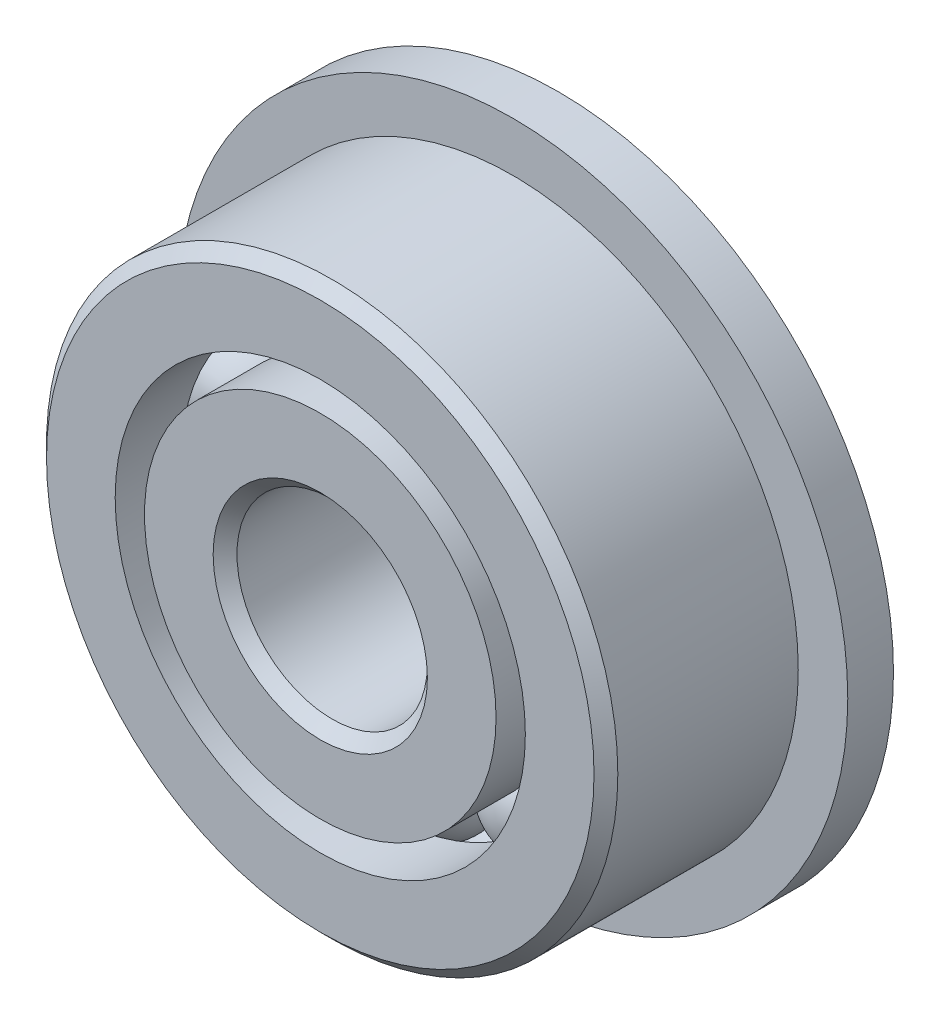
ISO-10303-21;
HEADER;
FILE_DESCRIPTION(('STEP AP214'),'2;1');
FILE_NAME('part.step','',(''),(''),'','','');
FILE_SCHEMA(('AUTOMOTIVE_DESIGN { 1 0 10303 214 1 1 1 1 }'));
ENDSEC;
DATA;
#1=APPLICATION_CONTEXT('core data for automotive mechanical design processes');
#2=APPLICATION_PROTOCOL_DEFINITION('international standard','automotive_design',2000,#1);
#3=PRODUCT_CONTEXT('',#1,'mechanical');
#4=PRODUCT('Part','Part','',(#3));
#5=PRODUCT_RELATED_PRODUCT_CATEGORY('part','',(#4));
#6=PRODUCT_DEFINITION_FORMATION('','',#4);
#7=PRODUCT_DEFINITION_CONTEXT('part definition',#1,'design');
#8=PRODUCT_DEFINITION('design','',#6,#7);
#9=PRODUCT_DEFINITION_SHAPE('','',#8);
#10=(LENGTH_UNIT() NAMED_UNIT(*) SI_UNIT(.MILLI.,.METRE.));
#11=(NAMED_UNIT(*) PLANE_ANGLE_UNIT() SI_UNIT($,.RADIAN.));
#12=(NAMED_UNIT(*) SI_UNIT($,.STERADIAN.) SOLID_ANGLE_UNIT());
#13=UNCERTAINTY_MEASURE_WITH_UNIT(LENGTH_MEASURE(1.E-05),#10,'distance_accuracy_value','');
#14=(GEOMETRIC_REPRESENTATION_CONTEXT(3) GLOBAL_UNCERTAINTY_ASSIGNED_CONTEXT((#13)) GLOBAL_UNIT_ASSIGNED_CONTEXT((#10,
#11,#12)) REPRESENTATION_CONTEXT('',''));
#15=CARTESIAN_POINT('',(0.,0.,0.));
#16=DIRECTION('',(0.,0.,1.));
#17=DIRECTION('',(1.,0.,0.));
#18=AXIS2_PLACEMENT_3D('',#15,#16,#17);
#19=CARTESIAN_POINT('',(-1.86621817602857,2.56862895714048,0.));
#20=DIRECTION('',(0.,0.,1.));
#21=DIRECTION('',(-0.587785252292462,0.809016994374955,0.));
#22=AXIS2_PLACEMENT_3D('',#19,#20,#21);
#23=SPHERICAL_SURFACE('',#22,0.915136422466876);
#24=CARTESIAN_POINT('',(-1.86621817602857,2.56862895714048,0.915136422466876));
#25=VERTEX_POINT('',#24);
#26=VERTEX_LOOP('',#25);
#27=FACE_BOUND('',#26,.T.);
#28=ADVANCED_FACE('F40',(#27),#23,.T.);
#29=CLOSED_SHELL('',(#28));
#30=MANIFOLD_SOLID_BREP('B2',#29);
#31=CARTESIAN_POINT('',(-3.0196044392371,0.981128957140492,0.));
#32=DIRECTION('',(0.,0.,1.));
#33=DIRECTION('',(-0.95105651629515,0.309016994374958,0.));
#34=AXIS2_PLACEMENT_3D('',#31,#32,#33);
#35=SPHERICAL_SURFACE('',#34,0.915136422466876);
#36=CARTESIAN_POINT('',(-3.0196044392371,0.981128957140492,0.915136422466876));
#37=VERTEX_POINT('',#36);
#38=VERTEX_LOOP('',#37);
#39=FACE_BOUND('',#38,.T.);
#40=ADVANCED_FACE('F61',(#39),#35,.T.);
#41=CLOSED_SHELL('',(#40));
#42=MANIFOLD_SOLID_BREP('B6',#41);
#43=CARTESIAN_POINT('',(-3.01960443923712,-0.981128957140429,0.));
#44=DIRECTION('',(0.,0.,1.));
#45=DIRECTION('',(-0.951056516295157,-0.309016994374938,0.));
#46=AXIS2_PLACEMENT_3D('',#43,#44,#45);
#47=SPHERICAL_SURFACE('',#46,0.915136422466876);
#48=CARTESIAN_POINT('',(-3.01960443923712,-0.981128957140429,0.915136422466876));
#49=VERTEX_POINT('',#48);
#50=VERTEX_LOOP('',#49);
#51=FACE_BOUND('',#50,.T.);
#52=ADVANCED_FACE('F82',(#51),#47,.T.);
#53=CLOSED_SHELL('',(#52));
#54=MANIFOLD_SOLID_BREP('B36',#53);
#55=CARTESIAN_POINT('',(-1.86621817602862,-2.56862895714044,0.));
#56=DIRECTION('',(0.,0.,1.));
#57=DIRECTION('',(-0.58778525229248,-0.809016994374942,0.));
#58=AXIS2_PLACEMENT_3D('',#55,#56,#57);
#59=SPHERICAL_SURFACE('',#58,0.915136422466876);
#60=CARTESIAN_POINT('',(-1.86621817602862,-2.56862895714044,0.915136422466876));
#61=VERTEX_POINT('',#60);
#62=VERTEX_LOOP('',#61);
#63=FACE_BOUND('',#62,.T.);
#64=ADVANCED_FACE('F103',(#63),#59,.T.);
#65=CLOSED_SHELL('',(#64));
#66=MANIFOLD_SOLID_BREP('B57',#65);
#67=CARTESIAN_POINT('',(0.,-3.175,0.));
#68=DIRECTION('',(0.,0.,1.));
#69=DIRECTION('',(0.,-1.,0.));
#70=AXIS2_PLACEMENT_3D('',#67,#68,#69);
#71=SPHERICAL_SURFACE('',#70,0.915136422466876);
#72=CARTESIAN_POINT('',(0.,-3.175,0.915136422466876));
#73=VERTEX_POINT('',#72);
#74=VERTEX_LOOP('',#73);
#75=FACE_BOUND('',#74,.T.);
#76=ADVANCED_FACE('F124',(#75),#71,.T.);
#77=CLOSED_SHELL('',(#76));
#78=MANIFOLD_SOLID_BREP('B78',#77);
#79=CARTESIAN_POINT('',(1.86621817602859,-2.56862895714047,0.));
#80=DIRECTION('',(0.,0.,1.));
#81=DIRECTION('',(0.587785252292469,-0.809016994374951,0.));
#82=AXIS2_PLACEMENT_3D('',#79,#80,#81);
#83=SPHERICAL_SURFACE('',#82,0.915136422466876);
#84=CARTESIAN_POINT('',(1.86621817602859,-2.56862895714047,0.915136422466876));
#85=VERTEX_POINT('',#84);
#86=VERTEX_LOOP('',#85);
#87=FACE_BOUND('',#86,.T.);
#88=ADVANCED_FACE('F145',(#87),#83,.T.);
#89=CLOSED_SHELL('',(#88));
#90=MANIFOLD_SOLID_BREP('B99',#89);
#91=CARTESIAN_POINT('',(3.01960443923711,-0.981128957140471,0.));
#92=DIRECTION('',(0.,0.,1.));
#93=DIRECTION('',(0.951056516295152,-0.309016994374952,0.));
#94=AXIS2_PLACEMENT_3D('',#91,#92,#93);
#95=SPHERICAL_SURFACE('',#94,0.915136422466876);
#96=CARTESIAN_POINT('',(3.01960443923711,-0.981128957140471,0.915136422466876));
#97=VERTEX_POINT('',#96);
#98=VERTEX_LOOP('',#97);
#99=FACE_BOUND('',#98,.T.);
#100=ADVANCED_FACE('F166',(#99),#95,.T.);
#101=CLOSED_SHELL('',(#100));
#102=MANIFOLD_SOLID_BREP('B120',#101);
#103=CARTESIAN_POINT('',(3.01960443923712,0.98112895714045,0.));
#104=DIRECTION('',(0.,0.,1.));
#105=DIRECTION('',(0.951056516295155,0.309016994374945,0.));
#106=AXIS2_PLACEMENT_3D('',#103,#104,#105);
#107=SPHERICAL_SURFACE('',#106,0.915136422466876);
#108=CARTESIAN_POINT('',(3.01960443923712,0.98112895714045,0.915136422466876));
#109=VERTEX_POINT('',#108);
#110=VERTEX_LOOP('',#109);
#111=FACE_BOUND('',#110,.T.);
#112=ADVANCED_FACE('F187',(#111),#107,.T.);
#113=CLOSED_SHELL('',(#112));
#114=MANIFOLD_SOLID_BREP('B141',#113);
#115=CARTESIAN_POINT('',(1.86621817602861,2.56862895714046,0.));
#116=DIRECTION('',(0.,0.,1.));
#117=DIRECTION('',(0.587785252292474,0.809016994374947,0.));
#118=AXIS2_PLACEMENT_3D('',#115,#116,#117);
#119=SPHERICAL_SURFACE('',#118,0.915136422466876);
#120=CARTESIAN_POINT('',(1.86621817602861,2.56862895714046,0.915136422466876));
#121=VERTEX_POINT('',#120);
#122=VERTEX_LOOP('',#121);
#123=FACE_BOUND('',#122,.T.);
#124=ADVANCED_FACE('F208',(#123),#119,.T.);
#125=CLOSED_SHELL('',(#124));
#126=MANIFOLD_SOLID_BREP('B162',#125);
#127=CARTESIAN_POINT('',(0.,3.175,0.));
#128=DIRECTION('',(0.,0.,1.));
#129=DIRECTION('',(0.,1.,0.));
#130=AXIS2_PLACEMENT_3D('',#127,#128,#129);
#131=SPHERICAL_SURFACE('',#130,0.915136422466876);
#132=CARTESIAN_POINT('',(0.,3.175,0.915136422466876));
#133=VERTEX_POINT('',#132);
#134=VERTEX_LOOP('',#133);
#135=FACE_BOUND('',#134,.T.);
#136=ADVANCED_FACE('F231',(#135),#131,.T.);
#137=CLOSED_SHELL('',(#136));
#138=MANIFOLD_SOLID_BREP('B183',#137);
#139=CARTESIAN_POINT('',(0.,2.93076923076923,1.984375));
#140=DIRECTION('',(0.,0.,-1.));
#141=DIRECTION('',(-1.,0.,0.));
#142=AXIS2_PLACEMENT_3D('',#139,#140,#141);
#143=PLANE('',#142);
#144=CARTESIAN_POINT('',(0.,0.,1.984375));
#145=DIRECTION('',(0.,0.,1.));
#146=DIRECTION('',(1.,0.,0.));
#147=AXIS2_PLACEMENT_3D('',#144,#145,#146);
#148=CIRCLE('',#147,1.7859375);
#149=CARTESIAN_POINT('',(1.7859375,0.,1.984375));
#150=VERTEX_POINT('',#149);
#151=EDGE_CURVE('E279',#150,#150,#148,.T.);
#152=ORIENTED_EDGE('',*,*,#151,.F.);
#153=EDGE_LOOP('',(#152));
#154=FACE_BOUND('',#153,.T.);
#155=CARTESIAN_POINT('',(0.,0.,1.984375));
#156=DIRECTION('',(0.,0.,1.));
#157=DIRECTION('',(1.,0.,0.));
#158=AXIS2_PLACEMENT_3D('',#155,#156,#157);
#159=CIRCLE('',#158,2.93076923076923);
#160=CARTESIAN_POINT('',(2.93076923076923,0.,1.984375));
#161=VERTEX_POINT('',#160);
#162=EDGE_CURVE('E230',#161,#161,#159,.T.);
#163=ORIENTED_EDGE('',*,*,#162,.T.);
#164=EDGE_LOOP('',(#163));
#165=FACE_BOUND('',#164,.T.);
#166=ADVANCED_FACE('F251',(#154,#165),#143,.F.);
#167=CARTESIAN_POINT('',(0.,0.,1.984375));
#168=DIRECTION('',(0.,0.,1.));
#169=DIRECTION('',(1.,0.,0.));
#170=AXIS2_PLACEMENT_3D('',#167,#168,#169);
#171=CYLINDRICAL_SURFACE('',#170,2.93076923076923);
#172=ORIENTED_EDGE('',*,*,#162,.F.);
#173=EDGE_LOOP('',(#172));
#174=FACE_BOUND('',#173,.T.);
#175=CARTESIAN_POINT('',(0.,0.,0.881944444444444));
#176=DIRECTION('',(0.,0.,1.));
#177=DIRECTION('',(1.,0.,0.));
#178=AXIS2_PLACEMENT_3D('',#175,#176,#177);
#179=CIRCLE('',#178,2.93076923076923);
#180=CARTESIAN_POINT('',(2.93076923076923,0.,0.881944444444444));
#181=VERTEX_POINT('',#180);
#182=EDGE_CURVE('E257',#181,#181,#179,.T.);
#183=ORIENTED_EDGE('',*,*,#182,.T.);
#184=EDGE_LOOP('',(#183));
#185=FACE_BOUND('',#184,.T.);
#186=ADVANCED_FACE('F286',(#174,#185),#171,.T.);
#187=CARTESIAN_POINT('',(0.,0.,0.));
#188=DIRECTION('',(0.,0.,1.));
#189=DIRECTION('',(1.,0.,0.));
#190=AXIS2_PLACEMENT_3D('',#187,#188,#189);
#191=TOROIDAL_SURFACE('',#190,3.175,0.915136422466875);
#192=ORIENTED_EDGE('',*,*,#182,.F.);
#193=EDGE_LOOP('',(#192));
#194=FACE_BOUND('',#193,.T.);
#195=CARTESIAN_POINT('',(0.,0.,-0.881944444444445));
#196=DIRECTION('',(0.,0.,1.));
#197=DIRECTION('',(1.,0.,0.));
#198=AXIS2_PLACEMENT_3D('',#195,#196,#197);
#199=CIRCLE('',#198,2.93076923076923);
#200=CARTESIAN_POINT('',(2.93076923076923,0.,-0.881944444444445));
#201=VERTEX_POINT('',#200);
#202=EDGE_CURVE('E261',#201,#201,#199,.T.);
#203=ORIENTED_EDGE('',*,*,#202,.T.);
#204=EDGE_LOOP('',(#203));
#205=FACE_BOUND('',#204,.T.);
#206=ADVANCED_FACE('F290',(#194,#205),#191,.F.);
#207=CARTESIAN_POINT('',(0.,0.,1.984375));
#208=DIRECTION('',(0.,0.,1.));
#209=DIRECTION('',(1.,0.,0.));
#210=AXIS2_PLACEMENT_3D('',#207,#208,#209);
#211=CYLINDRICAL_SURFACE('',#210,2.93076923076923);
#212=ORIENTED_EDGE('',*,*,#202,.F.);
#213=EDGE_LOOP('',(#212));
#214=FACE_BOUND('',#213,.T.);
#215=CARTESIAN_POINT('',(0.,0.,-1.984375));
#216=DIRECTION('',(0.,0.,1.));
#217=DIRECTION('',(1.,0.,0.));
#218=AXIS2_PLACEMENT_3D('',#215,#216,#217);
#219=CIRCLE('',#218,2.93076923076923);
#220=CARTESIAN_POINT('',(2.93076923076923,0.,-1.984375));
#221=VERTEX_POINT('',#220);
#222=EDGE_CURVE('E265',#221,#221,#219,.T.);
#223=ORIENTED_EDGE('',*,*,#222,.T.);
#224=EDGE_LOOP('',(#223));
#225=FACE_BOUND('',#224,.T.);
#226=ADVANCED_FACE('F295',(#214,#225),#211,.T.);
#227=CARTESIAN_POINT('',(0.,1.7859375,-1.984375));
#228=DIRECTION('',(0.,0.,1.));
#229=DIRECTION('',(1.,0.,0.));
#230=AXIS2_PLACEMENT_3D('',#227,#228,#229);
#231=PLANE('',#230);
#232=ORIENTED_EDGE('',*,*,#222,.F.);
#233=EDGE_LOOP('',(#232));
#234=FACE_BOUND('',#233,.T.);
#235=CARTESIAN_POINT('',(0.,0.,-1.984375));
#236=DIRECTION('',(0.,0.,1.));
#237=DIRECTION('',(1.,0.,0.));
#238=AXIS2_PLACEMENT_3D('',#235,#236,#237);
#239=CIRCLE('',#238,1.7859375);
#240=CARTESIAN_POINT('',(1.7859375,0.,-1.984375));
#241=VERTEX_POINT('',#240);
#242=EDGE_CURVE('E270',#241,#241,#239,.T.);
#243=ORIENTED_EDGE('',*,*,#242,.T.);
#244=EDGE_LOOP('',(#243));
#245=FACE_BOUND('',#244,.T.);
#246=ADVANCED_FACE('F301',(#234,#245),#231,.F.);
#247=CARTESIAN_POINT('',(0.,0.,-1.7859375));
#248=DIRECTION('',(0.,0.,-1.));
#249=DIRECTION('',(-1.,0.,0.));
#250=AXIS2_PLACEMENT_3D('',#247,#248,#249);
#251=CONICAL_SURFACE('',#250,1.5875,0.785398163397447);
#252=ORIENTED_EDGE('',*,*,#242,.F.);
#253=EDGE_LOOP('',(#252));
#254=FACE_BOUND('',#253,.T.);
#255=CARTESIAN_POINT('',(0.,0.,-1.7859375));
#256=DIRECTION('',(0.,0.,1.));
#257=DIRECTION('',(1.,0.,0.));
#258=AXIS2_PLACEMENT_3D('',#255,#256,#257);
#259=CIRCLE('',#258,1.5875);
#260=CARTESIAN_POINT('',(1.5875,0.,-1.7859375));
#261=VERTEX_POINT('',#260);
#262=EDGE_CURVE('E273',#261,#261,#259,.T.);
#263=ORIENTED_EDGE('',*,*,#262,.T.);
#264=EDGE_LOOP('',(#263));
#265=FACE_BOUND('',#264,.T.);
#266=ADVANCED_FACE('F305',(#254,#265),#251,.F.);
#267=CARTESIAN_POINT('',(0.,0.,1.984375));
#268=DIRECTION('',(0.,0.,1.));
#269=DIRECTION('',(1.,0.,0.));
#270=AXIS2_PLACEMENT_3D('',#267,#268,#269);
#271=CYLINDRICAL_SURFACE('',#270,1.5875);
#272=ORIENTED_EDGE('',*,*,#262,.F.);
#273=EDGE_LOOP('',(#272));
#274=FACE_BOUND('',#273,.T.);
#275=CARTESIAN_POINT('',(0.,0.,1.7859375));
#276=DIRECTION('',(0.,0.,1.));
#277=DIRECTION('',(1.,0.,0.));
#278=AXIS2_PLACEMENT_3D('',#275,#276,#277);
#279=CIRCLE('',#278,1.5875);
#280=CARTESIAN_POINT('',(1.5875,0.,1.7859375));
#281=VERTEX_POINT('',#280);
#282=EDGE_CURVE('E276',#281,#281,#279,.T.);
#283=ORIENTED_EDGE('',*,*,#282,.T.);
#284=EDGE_LOOP('',(#283));
#285=FACE_BOUND('',#284,.T.);
#286=ADVANCED_FACE('F309',(#274,#285),#271,.F.);
#287=CARTESIAN_POINT('',(0.,0.,1.984375));
#288=DIRECTION('',(0.,0.,1.));
#289=DIRECTION('',(1.,0.,0.));
#290=AXIS2_PLACEMENT_3D('',#287,#288,#289);
#291=CONICAL_SURFACE('',#290,1.7859375,0.785398163397449);
#292=ORIENTED_EDGE('',*,*,#282,.F.);
#293=EDGE_LOOP('',(#292));
#294=FACE_BOUND('',#293,.T.);
#295=ORIENTED_EDGE('',*,*,#151,.T.);
#296=EDGE_LOOP('',(#295));
#297=FACE_BOUND('',#296,.T.);
#298=ADVANCED_FACE('F283',(#294,#297),#291,.F.);
#299=CLOSED_SHELL('',(#166,#186,#206,#226,#246,#266,#286,#298));
#300=MANIFOLD_SOLID_BREP('B204',#299);
#301=CARTESIAN_POINT('',(0.,0.,1.7859375));
#302=DIRECTION('',(0.,0.,-1.));
#303=DIRECTION('',(-1.,0.,0.));
#304=AXIS2_PLACEMENT_3D('',#301,#302,#303);
#305=CONICAL_SURFACE('',#304,4.7625,0.785398163397448);
#306=CARTESIAN_POINT('',(0.,0.,1.984375));
#307=DIRECTION('',(0.,0.,1.));
#308=DIRECTION('',(1.,0.,0.));
#309=AXIS2_PLACEMENT_3D('',#306,#307,#308);
#310=CIRCLE('',#309,4.5640625);
#311=CARTESIAN_POINT('',(4.5640625,0.,1.984375));
#312=VERTEX_POINT('',#311);
#313=EDGE_CURVE('E395',#312,#312,#310,.T.);
#314=ORIENTED_EDGE('',*,*,#313,.F.);
#315=EDGE_LOOP('',(#314));
#316=FACE_BOUND('',#315,.T.);
#317=CARTESIAN_POINT('',(0.,0.,1.7859375));
#318=DIRECTION('',(0.,0.,1.));
#319=DIRECTION('',(1.,0.,0.));
#320=AXIS2_PLACEMENT_3D('',#317,#318,#319);
#321=CIRCLE('',#320,4.7625);
#322=CARTESIAN_POINT('',(4.7625,0.,1.7859375));
#323=VERTEX_POINT('',#322);
#324=EDGE_CURVE('E250',#323,#323,#321,.T.);
#325=ORIENTED_EDGE('',*,*,#324,.T.);
#326=EDGE_LOOP('',(#325));
#327=FACE_BOUND('',#326,.T.);
#328=ADVANCED_FACE('F373',(#316,#327),#305,.T.);
#329=CARTESIAN_POINT('',(0.,0.,1.984375));
#330=DIRECTION('',(0.,0.,1.));
#331=DIRECTION('',(1.,0.,0.));
#332=AXIS2_PLACEMENT_3D('',#329,#330,#331);
#333=CYLINDRICAL_SURFACE('',#332,4.7625);
#334=CARTESIAN_POINT('',(0.,0.,-1.222375));
#335=DIRECTION('',(0.,0.,1.));
#336=DIRECTION('',(1.,0.,0.));
#337=AXIS2_PLACEMENT_3D('',#334,#335,#336);
#338=CIRCLE('',#337,4.7625);
#339=CARTESIAN_POINT('',(4.7625,0.,-1.222375));
#340=VERTEX_POINT('',#339);
#341=EDGE_CURVE('E398',#340,#340,#338,.T.);
#342=ORIENTED_EDGE('',*,*,#341,.T.);
#343=EDGE_LOOP('',(#342));
#344=FACE_BOUND('',#343,.T.);
#345=ORIENTED_EDGE('',*,*,#324,.F.);
#346=EDGE_LOOP('',(#345));
#347=FACE_BOUND('',#346,.T.);
#348=ADVANCED_FACE('F418',(#344,#347),#333,.T.);
#349=CARTESIAN_POINT('',(0.,4.5640625,-1.984375));
#350=DIRECTION('',(0.,0.,1.));
#351=DIRECTION('',(1.,0.,0.));
#352=AXIS2_PLACEMENT_3D('',#349,#350,#351);
#353=PLANE('',#352);
#354=CARTESIAN_POINT('',(0.,0.,-1.984375));
#355=DIRECTION('',(0.,0.,1.));
#356=DIRECTION('',(1.,0.,0.));
#357=AXIS2_PLACEMENT_3D('',#354,#355,#356);
#358=CIRCLE('',#357,3.41923076923077);
#359=CARTESIAN_POINT('',(3.41923076923077,0.,-1.984375));
#360=VERTEX_POINT('',#359);
#361=EDGE_CURVE('E379',#360,#360,#358,.T.);
#362=ORIENTED_EDGE('',*,*,#361,.T.);
#363=EDGE_LOOP('',(#362));
#364=FACE_BOUND('',#363,.T.);
#365=CARTESIAN_POINT('',(0.,0.,-1.984375));
#366=DIRECTION('',(0.,0.,-1.));
#367=DIRECTION('',(-1.,0.,0.));
#368=AXIS2_PLACEMENT_3D('',#365,#366,#367);
#369=CIRCLE('',#368,5.588);
#370=CARTESIAN_POINT('',(-5.588,0.,-1.984375));
#371=VERTEX_POINT('',#370);
#372=EDGE_CURVE('E401',#371,#371,#369,.T.);
#373=ORIENTED_EDGE('',*,*,#372,.T.);
#374=EDGE_LOOP('',(#373));
#375=FACE_BOUND('',#374,.T.);
#376=ADVANCED_FACE('F421',(#364,#375),#353,.F.);
#377=CARTESIAN_POINT('',(0.,0.,1.984375));
#378=DIRECTION('',(0.,0.,1.));
#379=DIRECTION('',(1.,0.,0.));
#380=AXIS2_PLACEMENT_3D('',#377,#378,#379);
#381=CYLINDRICAL_SURFACE('',#380,3.41923076923077);
#382=CARTESIAN_POINT('',(0.,0.,-0.881944444444445));
#383=DIRECTION('',(0.,0.,1.));
#384=DIRECTION('',(1.,0.,0.));
#385=AXIS2_PLACEMENT_3D('',#382,#383,#384);
#386=CIRCLE('',#385,3.41923076923077);
#387=CARTESIAN_POINT('',(3.41923076923077,0.,-0.881944444444445));
#388=VERTEX_POINT('',#387);
#389=EDGE_CURVE('E383',#388,#388,#386,.T.);
#390=ORIENTED_EDGE('',*,*,#389,.T.);
#391=EDGE_LOOP('',(#390));
#392=FACE_BOUND('',#391,.T.);
#393=ORIENTED_EDGE('',*,*,#361,.F.);
#394=EDGE_LOOP('',(#393));
#395=FACE_BOUND('',#394,.T.);
#396=ADVANCED_FACE('F426',(#392,#395),#381,.F.);
#397=CARTESIAN_POINT('',(0.,0.,0.));
#398=DIRECTION('',(0.,0.,1.));
#399=DIRECTION('',(1.,0.,0.));
#400=AXIS2_PLACEMENT_3D('',#397,#398,#399);
#401=TOROIDAL_SURFACE('',#400,3.175,0.915136422466876);
#402=ORIENTED_EDGE('',*,*,#389,.F.);
#403=EDGE_LOOP('',(#402));
#404=FACE_BOUND('',#403,.T.);
#405=CARTESIAN_POINT('',(0.,0.,0.881944444444444));
#406=DIRECTION('',(0.,0.,1.));
#407=DIRECTION('',(1.,0.,0.));
#408=AXIS2_PLACEMENT_3D('',#405,#406,#407);
#409=CIRCLE('',#408,3.41923076923077);
#410=CARTESIAN_POINT('',(3.41923076923077,0.,0.881944444444444));
#411=VERTEX_POINT('',#410);
#412=EDGE_CURVE('E387',#411,#411,#409,.T.);
#413=ORIENTED_EDGE('',*,*,#412,.T.);
#414=EDGE_LOOP('',(#413));
#415=FACE_BOUND('',#414,.T.);
#416=ADVANCED_FACE('F432',(#404,#415),#401,.F.);
#417=CARTESIAN_POINT('',(0.,0.,1.984375));
#418=DIRECTION('',(0.,0.,1.));
#419=DIRECTION('',(1.,0.,0.));
#420=AXIS2_PLACEMENT_3D('',#417,#418,#419);
#421=CYLINDRICAL_SURFACE('',#420,3.41923076923077);
#422=ORIENTED_EDGE('',*,*,#412,.F.);
#423=EDGE_LOOP('',(#422));
#424=FACE_BOUND('',#423,.T.);
#425=CARTESIAN_POINT('',(0.,0.,1.984375));
#426=DIRECTION('',(0.,0.,1.));
#427=DIRECTION('',(1.,0.,0.));
#428=AXIS2_PLACEMENT_3D('',#425,#426,#427);
#429=CIRCLE('',#428,3.41923076923077);
#430=CARTESIAN_POINT('',(3.41923076923077,0.,1.984375));
#431=VERTEX_POINT('',#430);
#432=EDGE_CURVE('E392',#431,#431,#429,.T.);
#433=ORIENTED_EDGE('',*,*,#432,.T.);
#434=EDGE_LOOP('',(#433));
#435=FACE_BOUND('',#434,.T.);
#436=ADVANCED_FACE('F436',(#424,#435),#421,.F.);
#437=CARTESIAN_POINT('',(0.,4.5640625,1.984375));
#438=DIRECTION('',(0.,0.,-1.));
#439=DIRECTION('',(-1.,0.,0.));
#440=AXIS2_PLACEMENT_3D('',#437,#438,#439);
#441=PLANE('',#440);
#442=ORIENTED_EDGE('',*,*,#432,.F.);
#443=EDGE_LOOP('',(#442));
#444=FACE_BOUND('',#443,.T.);
#445=ORIENTED_EDGE('',*,*,#313,.T.);
#446=EDGE_LOOP('',(#445));
#447=FACE_BOUND('',#446,.T.);
#448=ADVANCED_FACE('F414',(#444,#447),#441,.F.);
#449=CARTESIAN_POINT('',(0.,3.41923076923077,-1.222375));
#450=DIRECTION('',(0.,0.,1.));
#451=DIRECTION('',(1.,0.,0.));
#452=AXIS2_PLACEMENT_3D('',#449,#450,#451);
#453=PLANE('',#452);
#454=CARTESIAN_POINT('',(0.,0.,-1.222375));
#455=DIRECTION('',(0.,0.,-1.));
#456=DIRECTION('',(-1.,0.,0.));
#457=AXIS2_PLACEMENT_3D('',#454,#455,#456);
#458=CIRCLE('',#457,5.588);
#459=CARTESIAN_POINT('',(-5.588,0.,-1.222375));
#460=VERTEX_POINT('',#459);
#461=EDGE_CURVE('E404',#460,#460,#458,.T.);
#462=ORIENTED_EDGE('',*,*,#461,.F.);
#463=EDGE_LOOP('',(#462));
#464=FACE_BOUND('',#463,.T.);
#465=ORIENTED_EDGE('',*,*,#341,.F.);
#466=EDGE_LOOP('',(#465));
#467=FACE_BOUND('',#466,.T.);
#468=ADVANCED_FACE('F411',(#464,#467),#453,.T.);
#469=CARTESIAN_POINT('',(0.,0.,-1.984375));
#470=DIRECTION('',(0.,0.,-1.));
#471=DIRECTION('',(-1.,0.,0.));
#472=AXIS2_PLACEMENT_3D('',#469,#470,#471);
#473=CYLINDRICAL_SURFACE('',#472,5.588);
#474=ORIENTED_EDGE('',*,*,#461,.T.);
#475=EDGE_LOOP('',(#474));
#476=FACE_BOUND('',#475,.T.);
#477=ORIENTED_EDGE('',*,*,#372,.F.);
#478=EDGE_LOOP('',(#477));
#479=FACE_BOUND('',#478,.T.);
#480=ADVANCED_FACE('F408',(#476,#479),#473,.T.);
#481=CLOSED_SHELL('',(#328,#348,#376,#396,#416,#436,#448,#468,#480));
#482=MANIFOLD_SOLID_BREP('B225',#481);
#483=ADVANCED_BREP_SHAPE_REPRESENTATION('',(#18,#30,#42,#54,#66,#78,#90,#102,#114,#126,#138,
#300,#482),#14);
#484=SHAPE_DEFINITION_REPRESENTATION(#9,#483);
ENDSEC;
END-ISO-10303-21;
